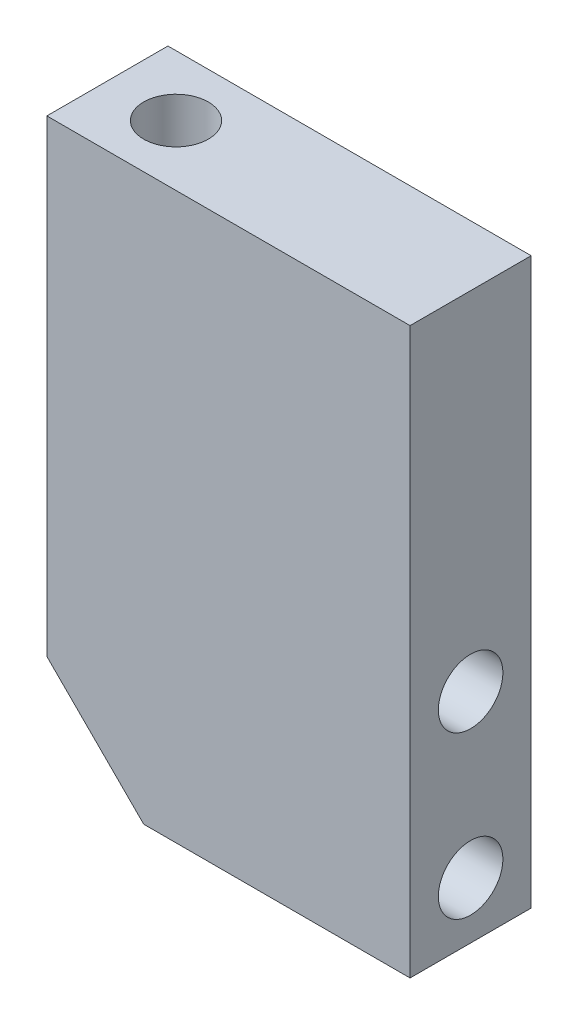
ISO-10303-21;
HEADER;
FILE_DESCRIPTION(('STEP AP214'),'2;1');
FILE_NAME('part.step','',(''),(''),'','','');
FILE_SCHEMA(('AUTOMOTIVE_DESIGN { 1 0 10303 214 1 1 1 1 }'));
ENDSEC;
DATA;
#1=APPLICATION_CONTEXT('core data for automotive mechanical design processes');
#2=APPLICATION_PROTOCOL_DEFINITION('international standard','automotive_design',2000,#1);
#3=PRODUCT_CONTEXT('',#1,'mechanical');
#4=PRODUCT('Part','Part','',(#3));
#5=PRODUCT_RELATED_PRODUCT_CATEGORY('part','',(#4));
#6=PRODUCT_DEFINITION_FORMATION('','',#4);
#7=PRODUCT_DEFINITION_CONTEXT('part definition',#1,'design');
#8=PRODUCT_DEFINITION('design','',#6,#7);
#9=PRODUCT_DEFINITION_SHAPE('','',#8);
#10=(LENGTH_UNIT() NAMED_UNIT(*) SI_UNIT(.MILLI.,.METRE.));
#11=(NAMED_UNIT(*) PLANE_ANGLE_UNIT() SI_UNIT($,.RADIAN.));
#12=(NAMED_UNIT(*) SI_UNIT($,.STERADIAN.) SOLID_ANGLE_UNIT());
#13=UNCERTAINTY_MEASURE_WITH_UNIT(LENGTH_MEASURE(1.E-05),#10,'distance_accuracy_value','');
#14=(GEOMETRIC_REPRESENTATION_CONTEXT(3) GLOBAL_UNCERTAINTY_ASSIGNED_CONTEXT((#13)) GLOBAL_UNIT_ASSIGNED_CONTEXT((#10,
#11,#12)) REPRESENTATION_CONTEXT('',''));
#15=CARTESIAN_POINT('',(0.,0.,0.));
#16=DIRECTION('',(0.,0.,1.));
#17=DIRECTION('',(1.,0.,0.));
#18=AXIS2_PLACEMENT_3D('',#15,#16,#17);
#19=CARTESIAN_POINT('',(-22.5,-35.,15.));
#20=DIRECTION('',(1.,0.,0.));
#21=DIRECTION('',(0.,0.,-1.));
#22=AXIS2_PLACEMENT_3D('',#19,#20,#21);
#23=PLANE('',#22);
#24=DIRECTION('',(0.,-1.,0.));
#25=VECTOR('',#24,1.);
#26=CARTESIAN_POINT('',(-22.5,-35.,0.));
#27=LINE('',#26,#25);
#28=CARTESIAN_POINT('',(-22.5,35.,0.));
#29=VERTEX_POINT('',#28);
#30=CARTESIAN_POINT('',(-22.5,-23.,0.));
#31=VERTEX_POINT('',#30);
#32=EDGE_CURVE('E109',#29,#31,#27,.T.);
#33=ORIENTED_EDGE('',*,*,#32,.T.);
#34=DIRECTION('',(0.,0.,1.));
#35=VECTOR('',#34,1.);
#36=CARTESIAN_POINT('',(-22.5,-23.,15.));
#37=LINE('',#36,#35);
#38=CARTESIAN_POINT('',(-22.5,-23.,15.));
#39=VERTEX_POINT('',#38);
#40=EDGE_CURVE('E41',#31,#39,#37,.T.);
#41=ORIENTED_EDGE('',*,*,#40,.T.);
#42=DIRECTION('',(0.,-1.,0.));
#43=VECTOR('',#42,1.);
#44=CARTESIAN_POINT('',(-22.5,-35.,15.));
#45=LINE('',#44,#43);
#46=CARTESIAN_POINT('',(-22.5,35.,15.));
#47=VERTEX_POINT('',#46);
#48=EDGE_CURVE('E89',#47,#39,#45,.T.);
#49=ORIENTED_EDGE('',*,*,#48,.F.);
#50=DIRECTION('',(0.,0.,-1.));
#51=VECTOR('',#50,1.);
#52=CARTESIAN_POINT('',(-22.5,35.,15.));
#53=LINE('',#52,#51);
#54=EDGE_CURVE('E105',#47,#29,#53,.T.);
#55=ORIENTED_EDGE('',*,*,#54,.T.);
#56=EDGE_LOOP('',(#33,#41,#49,#55));
#57=FACE_BOUND('',#56,.T.);
#58=ADVANCED_FACE('F33',(#57),#23,.F.);
#59=CARTESIAN_POINT('',(22.5,-35.,15.));
#60=DIRECTION('',(0.,1.,0.));
#61=DIRECTION('',(-1.,0.,0.));
#62=AXIS2_PLACEMENT_3D('',#59,#60,#61);
#63=PLANE('',#62);
#64=DIRECTION('',(1.,0.,0.));
#65=VECTOR('',#64,1.);
#66=CARTESIAN_POINT('',(22.5,-35.,15.));
#67=LINE('',#66,#65);
#68=CARTESIAN_POINT('',(-10.5,-35.,15.));
#69=VERTEX_POINT('',#68);
#70=CARTESIAN_POINT('',(22.5,-35.,15.));
#71=VERTEX_POINT('',#70);
#72=EDGE_CURVE('E79',#69,#71,#67,.T.);
#73=ORIENTED_EDGE('',*,*,#72,.F.);
#74=DIRECTION('',(0.,0.,-1.));
#75=VECTOR('',#74,1.);
#76=CARTESIAN_POINT('',(-10.5,-35.,15.));
#77=LINE('',#76,#75);
#78=CARTESIAN_POINT('',(-10.5,-35.,0.));
#79=VERTEX_POINT('',#78);
#80=EDGE_CURVE('E97',#69,#79,#77,.T.);
#81=ORIENTED_EDGE('',*,*,#80,.T.);
#82=DIRECTION('',(1.,0.,0.));
#83=VECTOR('',#82,1.);
#84=CARTESIAN_POINT('',(22.5,-35.,0.));
#85=LINE('',#84,#83);
#86=CARTESIAN_POINT('',(22.5,-35.,0.));
#87=VERTEX_POINT('',#86);
#88=EDGE_CURVE('E94',#79,#87,#85,.T.);
#89=ORIENTED_EDGE('',*,*,#88,.T.);
#90=DIRECTION('',(0.,0.,-1.));
#91=VECTOR('',#90,1.);
#92=CARTESIAN_POINT('',(22.5,-35.,15.));
#93=LINE('',#92,#91);
#94=EDGE_CURVE('E92',#71,#87,#93,.T.);
#95=ORIENTED_EDGE('',*,*,#94,.F.);
#96=EDGE_LOOP('',(#73,#81,#89,#95));
#97=FACE_BOUND('',#96,.T.);
#98=ADVANCED_FACE('F93',(#97),#63,.F.);
#99=CARTESIAN_POINT('',(22.5,-35.,15.));
#100=DIRECTION('',(-1.,0.,0.));
#101=DIRECTION('',(0.,0.,1.));
#102=AXIS2_PLACEMENT_3D('',#99,#100,#101);
#103=PLANE('',#102);
#104=CARTESIAN_POINT('',(22.5,-28.,7.5));
#105=DIRECTION('',(1.,0.,0.));
#106=DIRECTION('',(0.,0.,-1.));
#107=AXIS2_PLACEMENT_3D('',#104,#105,#106);
#108=CIRCLE('',#107,4.);
#109=CARTESIAN_POINT('',(22.5,-28.,3.5));
#110=VERTEX_POINT('',#109);
#111=EDGE_CURVE('E175',#110,#110,#108,.T.);
#112=ORIENTED_EDGE('',*,*,#111,.F.);
#113=EDGE_LOOP('',(#112));
#114=FACE_BOUND('',#113,.T.);
#115=CARTESIAN_POINT('',(22.5,-8.,7.5));
#116=DIRECTION('',(1.,0.,0.));
#117=DIRECTION('',(0.,0.,-1.));
#118=AXIS2_PLACEMENT_3D('',#115,#116,#117);
#119=CIRCLE('',#118,4.);
#120=CARTESIAN_POINT('',(22.5,-8.,3.5));
#121=VERTEX_POINT('',#120);
#122=EDGE_CURVE('E185',#121,#121,#119,.T.);
#123=ORIENTED_EDGE('',*,*,#122,.F.);
#124=EDGE_LOOP('',(#123));
#125=FACE_BOUND('',#124,.T.);
#126=DIRECTION('',(0.,1.,0.));
#127=VECTOR('',#126,1.);
#128=CARTESIAN_POINT('',(22.5,-35.,0.));
#129=LINE('',#128,#127);
#130=CARTESIAN_POINT('',(22.5,35.,0.));
#131=VERTEX_POINT('',#130);
#132=EDGE_CURVE('E113',#87,#131,#129,.T.);
#133=ORIENTED_EDGE('',*,*,#132,.T.);
#134=DIRECTION('',(0.,0.,-1.));
#135=VECTOR('',#134,1.);
#136=CARTESIAN_POINT('',(22.5,35.,15.));
#137=LINE('',#136,#135);
#138=CARTESIAN_POINT('',(22.5,35.,15.));
#139=VERTEX_POINT('',#138);
#140=EDGE_CURVE('E98',#139,#131,#137,.T.);
#141=ORIENTED_EDGE('',*,*,#140,.F.);
#142=DIRECTION('',(0.,1.,0.));
#143=VECTOR('',#142,1.);
#144=CARTESIAN_POINT('',(22.5,-35.,15.));
#145=LINE('',#144,#143);
#146=EDGE_CURVE('E83',#71,#139,#145,.T.);
#147=ORIENTED_EDGE('',*,*,#146,.F.);
#148=ORIENTED_EDGE('',*,*,#94,.T.);
#149=EDGE_LOOP('',(#133,#141,#147,#148));
#150=FACE_BOUND('',#149,.T.);
#151=ADVANCED_FACE('F100',(#114,#125,#150),#103,.F.);
#152=CARTESIAN_POINT('',(22.5,35.,15.));
#153=DIRECTION('',(0.,-1.,0.));
#154=DIRECTION('',(1.,0.,0.));
#155=AXIS2_PLACEMENT_3D('',#152,#153,#154);
#156=PLANE('',#155);
#157=CARTESIAN_POINT('',(-14.,35.,7.5));
#158=DIRECTION('',(0.,1.,0.));
#159=DIRECTION('',(-1.,0.,0.));
#160=AXIS2_PLACEMENT_3D('',#157,#158,#159);
#161=CIRCLE('',#160,4.);
#162=CARTESIAN_POINT('',(-18.,35.,7.5));
#163=VERTEX_POINT('',#162);
#164=EDGE_CURVE('E174',#163,#163,#161,.T.);
#165=ORIENTED_EDGE('',*,*,#164,.F.);
#166=EDGE_LOOP('',(#165));
#167=FACE_BOUND('',#166,.T.);
#168=DIRECTION('',(-1.,0.,0.));
#169=VECTOR('',#168,1.);
#170=CARTESIAN_POINT('',(22.5,35.,0.));
#171=LINE('',#170,#169);
#172=EDGE_CURVE('E115',#131,#29,#171,.T.);
#173=ORIENTED_EDGE('',*,*,#172,.T.);
#174=ORIENTED_EDGE('',*,*,#54,.F.);
#175=DIRECTION('',(-1.,0.,0.));
#176=VECTOR('',#175,1.);
#177=CARTESIAN_POINT('',(22.5,35.,15.));
#178=LINE('',#177,#176);
#179=EDGE_CURVE('E103',#139,#47,#178,.T.);
#180=ORIENTED_EDGE('',*,*,#179,.F.);
#181=ORIENTED_EDGE('',*,*,#140,.T.);
#182=EDGE_LOOP('',(#173,#174,#180,#181));
#183=FACE_BOUND('',#182,.T.);
#184=ADVANCED_FACE('F125',(#167,#183),#156,.F.);
#185=CARTESIAN_POINT('',(0.,0.,15.));
#186=DIRECTION('',(0.,0.,1.));
#187=DIRECTION('',(1.,0.,0.));
#188=AXIS2_PLACEMENT_3D('',#185,#186,#187);
#189=PLANE('',#188);
#190=ORIENTED_EDGE('',*,*,#48,.T.);
#191=DIRECTION('',(-0.707106781186546,0.707106781186549,0.));
#192=VECTOR('',#191,1.);
#193=CARTESIAN_POINT('',(-22.75,-22.75,15.));
#194=LINE('',#193,#192);
#195=EDGE_CURVE('E11',#39,#69,#194,.F.);
#196=ORIENTED_EDGE('',*,*,#195,.T.);
#197=ORIENTED_EDGE('',*,*,#72,.T.);
#198=ORIENTED_EDGE('',*,*,#146,.T.);
#199=ORIENTED_EDGE('',*,*,#179,.T.);
#200=EDGE_LOOP('',(#190,#196,#197,#198,#199));
#201=FACE_BOUND('',#200,.T.);
#202=ADVANCED_FACE('F81',(#201),#189,.T.);
#203=CARTESIAN_POINT('',(0.,0.,0.));
#204=DIRECTION('',(0.,0.,1.));
#205=DIRECTION('',(1.,0.,0.));
#206=AXIS2_PLACEMENT_3D('',#203,#204,#205);
#207=PLANE('',#206);
#208=ORIENTED_EDGE('',*,*,#88,.F.);
#209=DIRECTION('',(0.707106781186546,-0.707106781186549,0.));
#210=VECTOR('',#209,1.);
#211=CARTESIAN_POINT('',(-10.5,-35.,0.));
#212=LINE('',#211,#210);
#213=EDGE_CURVE('E55',#79,#31,#212,.F.);
#214=ORIENTED_EDGE('',*,*,#213,.T.);
#215=ORIENTED_EDGE('',*,*,#32,.F.);
#216=ORIENTED_EDGE('',*,*,#172,.F.);
#217=ORIENTED_EDGE('',*,*,#132,.F.);
#218=EDGE_LOOP('',(#208,#214,#215,#216,#217));
#219=FACE_BOUND('',#218,.T.);
#220=ADVANCED_FACE('F122',(#219),#207,.F.);
#221=CARTESIAN_POINT('',(-14.,20.,7.5));
#222=DIRECTION('',(0.,1.,0.));
#223=DIRECTION('',(-1.,0.,0.));
#224=AXIS2_PLACEMENT_3D('',#221,#222,#223);
#225=CYLINDRICAL_SURFACE('',#224,4.);
#226=CARTESIAN_POINT('',(-14.,20.,7.5));
#227=DIRECTION('',(0.,1.,0.));
#228=DIRECTION('',(-1.,0.,0.));
#229=AXIS2_PLACEMENT_3D('',#226,#227,#228);
#230=CIRCLE('',#229,4.);
#231=CARTESIAN_POINT('',(-18.,20.,7.5));
#232=VERTEX_POINT('',#231);
#233=EDGE_CURVE('E111',#232,#232,#230,.T.);
#234=ORIENTED_EDGE('',*,*,#233,.F.);
#235=EDGE_LOOP('',(#234));
#236=FACE_BOUND('',#235,.T.);
#237=ORIENTED_EDGE('',*,*,#164,.T.);
#238=EDGE_LOOP('',(#237));
#239=FACE_BOUND('',#238,.T.);
#240=ADVANCED_FACE('F137',(#236,#239),#225,.F.);
#241=CARTESIAN_POINT('',(-14.,20.,7.5));
#242=DIRECTION('',(0.,1.,0.));
#243=DIRECTION('',(-1.,0.,0.));
#244=AXIS2_PLACEMENT_3D('',#241,#242,#243);
#245=PLANE('',#244);
#246=ORIENTED_EDGE('',*,*,#233,.T.);
#247=EDGE_LOOP('',(#246));
#248=FACE_BOUND('',#247,.T.);
#249=ADVANCED_FACE('F129',(#248),#245,.T.);
#250=CARTESIAN_POINT('',(-10.5,-35.,15.));
#251=DIRECTION('',(0.707106781186549,0.707106781186546,0.));
#252=DIRECTION('',(0.,0.,-1.));
#253=AXIS2_PLACEMENT_3D('',#250,#251,#252);
#254=PLANE('',#253);
#255=ORIENTED_EDGE('',*,*,#195,.F.);
#256=ORIENTED_EDGE('',*,*,#40,.F.);
#257=ORIENTED_EDGE('',*,*,#213,.F.);
#258=ORIENTED_EDGE('',*,*,#80,.F.);
#259=EDGE_LOOP('',(#255,#256,#257,#258));
#260=FACE_BOUND('',#259,.T.);
#261=ADVANCED_FACE('F35',(#260),#254,.F.);
#262=CARTESIAN_POINT('',(-2.5,-8.,7.5));
#263=DIRECTION('',(1.,0.,0.));
#264=DIRECTION('',(0.,0.,-1.));
#265=AXIS2_PLACEMENT_3D('',#262,#263,#264);
#266=CYLINDRICAL_SURFACE('',#265,4.);
#267=CARTESIAN_POINT('',(-2.5,-8.,7.5));
#268=DIRECTION('',(1.,0.,0.));
#269=DIRECTION('',(0.,0.,-1.));
#270=AXIS2_PLACEMENT_3D('',#267,#268,#269);
#271=CIRCLE('',#270,4.);
#272=CARTESIAN_POINT('',(-2.5,-8.,3.5));
#273=VERTEX_POINT('',#272);
#274=EDGE_CURVE('E180',#273,#273,#271,.T.);
#275=ORIENTED_EDGE('',*,*,#274,.F.);
#276=EDGE_LOOP('',(#275));
#277=FACE_BOUND('',#276,.T.);
#278=ORIENTED_EDGE('',*,*,#122,.T.);
#279=EDGE_LOOP('',(#278));
#280=FACE_BOUND('',#279,.T.);
#281=ADVANCED_FACE('F128',(#277,#280),#266,.F.);
#282=CARTESIAN_POINT('',(-2.5,-8.,7.5));
#283=DIRECTION('',(1.,0.,0.));
#284=DIRECTION('',(0.,0.,-1.));
#285=AXIS2_PLACEMENT_3D('',#282,#283,#284);
#286=PLANE('',#285);
#287=ORIENTED_EDGE('',*,*,#274,.T.);
#288=EDGE_LOOP('',(#287));
#289=FACE_BOUND('',#288,.T.);
#290=ADVANCED_FACE('F134',(#289),#286,.T.);
#291=CARTESIAN_POINT('',(-2.5,-28.,7.5));
#292=DIRECTION('',(1.,0.,0.));
#293=DIRECTION('',(0.,0.,-1.));
#294=AXIS2_PLACEMENT_3D('',#291,#292,#293);
#295=CYLINDRICAL_SURFACE('',#294,4.);
#296=CARTESIAN_POINT('',(-2.5,-28.,7.5));
#297=DIRECTION('',(1.,0.,0.));
#298=DIRECTION('',(0.,0.,-1.));
#299=AXIS2_PLACEMENT_3D('',#296,#297,#298);
#300=CIRCLE('',#299,4.);
#301=CARTESIAN_POINT('',(-2.5,-28.,3.5));
#302=VERTEX_POINT('',#301);
#303=EDGE_CURVE('E173',#302,#302,#300,.T.);
#304=ORIENTED_EDGE('',*,*,#303,.F.);
#305=EDGE_LOOP('',(#304));
#306=FACE_BOUND('',#305,.T.);
#307=ORIENTED_EDGE('',*,*,#111,.T.);
#308=EDGE_LOOP('',(#307));
#309=FACE_BOUND('',#308,.T.);
#310=ADVANCED_FACE('F161',(#306,#309),#295,.F.);
#311=CARTESIAN_POINT('',(-2.5,-28.,7.5));
#312=DIRECTION('',(1.,0.,0.));
#313=DIRECTION('',(0.,0.,-1.));
#314=AXIS2_PLACEMENT_3D('',#311,#312,#313);
#315=PLANE('',#314);
#316=ORIENTED_EDGE('',*,*,#303,.T.);
#317=EDGE_LOOP('',(#316));
#318=FACE_BOUND('',#317,.T.);
#319=ADVANCED_FACE('F165',(#318),#315,.T.);
#320=CLOSED_SHELL('',(#58,#98,#151,#184,#202,#220,#240,#249,#261,#281,#290,#310,#319));
#321=MANIFOLD_SOLID_BREP('B2',#320);
#322=ADVANCED_BREP_SHAPE_REPRESENTATION('',(#18,#321),#14);
#323=SHAPE_DEFINITION_REPRESENTATION(#9,#322);
ENDSEC;
END-ISO-10303-21;
